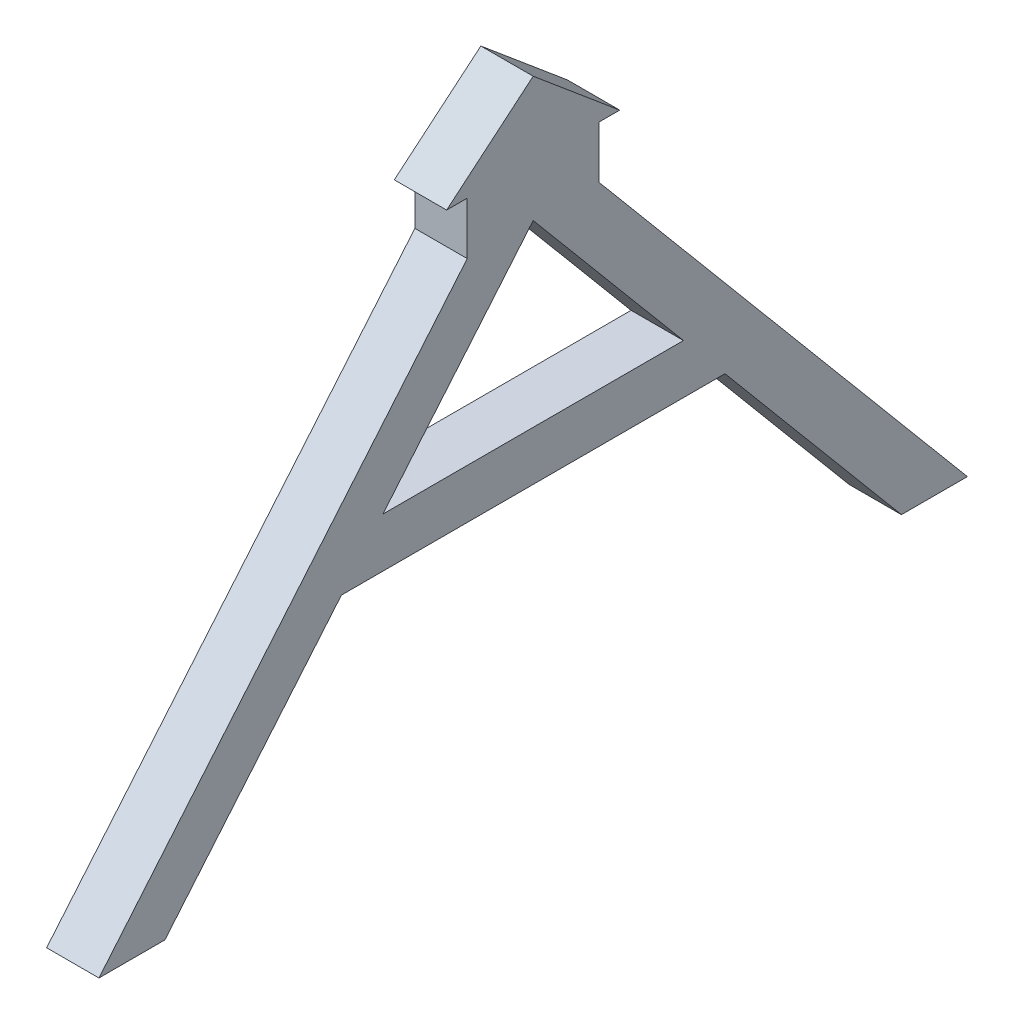
ISO-10303-21;
HEADER;
FILE_DESCRIPTION(('STEP AP214'),'2;1');
FILE_NAME('part.step','',(''),(''),'','','');
FILE_SCHEMA(('AUTOMOTIVE_DESIGN { 1 0 10303 214 1 1 1 1 }'));
ENDSEC;
DATA;
#1=APPLICATION_CONTEXT('core data for automotive mechanical design processes');
#2=APPLICATION_PROTOCOL_DEFINITION('international standard','automotive_design',2000,#1);
#3=PRODUCT_CONTEXT('',#1,'mechanical');
#4=PRODUCT('Part','Part','',(#3));
#5=PRODUCT_RELATED_PRODUCT_CATEGORY('part','',(#4));
#6=PRODUCT_DEFINITION_FORMATION('','',#4);
#7=PRODUCT_DEFINITION_CONTEXT('part definition',#1,'design');
#8=PRODUCT_DEFINITION('design','',#6,#7);
#9=PRODUCT_DEFINITION_SHAPE('','',#8);
#10=(LENGTH_UNIT() NAMED_UNIT(*) SI_UNIT(.MILLI.,.METRE.));
#11=(NAMED_UNIT(*) PLANE_ANGLE_UNIT() SI_UNIT($,.RADIAN.));
#12=(NAMED_UNIT(*) SI_UNIT($,.STERADIAN.) SOLID_ANGLE_UNIT());
#13=UNCERTAINTY_MEASURE_WITH_UNIT(LENGTH_MEASURE(1.E-05),#10,'distance_accuracy_value','');
#14=(GEOMETRIC_REPRESENTATION_CONTEXT(3) GLOBAL_UNCERTAINTY_ASSIGNED_CONTEXT((#13)) GLOBAL_UNIT_ASSIGNED_CONTEXT((#10,
#11,#12)) REPRESENTATION_CONTEXT('',''));
#15=CARTESIAN_POINT('',(0.,0.,0.));
#16=DIRECTION('',(0.,0.,1.));
#17=DIRECTION('',(1.,0.,0.));
#18=AXIS2_PLACEMENT_3D('',#15,#16,#17);
#19=CARTESIAN_POINT('',(3.175,0.,0.));
#20=DIRECTION('',(1.,0.,0.));
#21=DIRECTION('',(0.,0.,-1.));
#22=AXIS2_PLACEMENT_3D('',#19,#20,#21);
#23=PLANE('',#22);
#24=DIRECTION('',(0.,-0.642787609686535,0.766044443118982));
#25=VECTOR('',#24,1.);
#26=CARTESIAN_POINT('',(3.175,4.40527306368067,-5.25));
#27=LINE('',#26,#25);
#28=CARTESIAN_POINT('',(3.175,4.40527306368067,-5.25));
#29=VERTEX_POINT('',#28);
#30=CARTESIAN_POINT('',(3.175,0.,0.));
#31=VERTEX_POINT('',#30);
#32=EDGE_CURVE('E189',#29,#31,#27,.T.);
#33=ORIENTED_EDGE('',*,*,#32,.T.);
#34=DIRECTION('',(0.,0.,-1.));
#35=VECTOR('',#34,1.);
#36=CARTESIAN_POINT('',(3.175,0.,0.));
#37=LINE('',#36,#35);
#38=CARTESIAN_POINT('',(3.175,0.,-1.25));
#39=VERTEX_POINT('',#38);
#40=EDGE_CURVE('E193',#31,#39,#37,.T.);
#41=ORIENTED_EDGE('',*,*,#40,.T.);
#42=DIRECTION('',(0.,-1.,0.));
#43=VECTOR('',#42,1.);
#44=CARTESIAN_POINT('',(3.175,0.,-1.25));
#45=LINE('',#44,#43);
#46=CARTESIAN_POINT('',(3.175,-3.175,-1.25));
#47=VERTEX_POINT('',#46);
#48=EDGE_CURVE('E197',#39,#47,#45,.T.);
#49=ORIENTED_EDGE('',*,*,#48,.T.);
#50=DIRECTION('',(0.,-0.766044443118979,0.642787609686538));
#51=VECTOR('',#50,1.);
#52=CARTESIAN_POINT('',(3.175,-3.175,-1.25));
#53=LINE('',#52,#51);
#54=CARTESIAN_POINT('',(3.175,-29.7961311017385,21.0877812889907));
#55=VERTEX_POINT('',#54);
#56=EDGE_CURVE('E200',#47,#55,#53,.T.);
#57=ORIENTED_EDGE('',*,*,#56,.T.);
#58=DIRECTION('',(0.,0.,-1.));
#59=VECTOR('',#58,1.);
#60=CARTESIAN_POINT('',(3.175,-29.7961311017385,21.0877812889907));
#61=LINE('',#60,#59);
#62=CARTESIAN_POINT('',(3.175,-29.7961311017385,17.0877812889907));
#63=VERTEX_POINT('',#62);
#64=EDGE_CURVE('E203',#55,#63,#61,.T.);
#65=ORIENTED_EDGE('',*,*,#64,.T.);
#66=DIRECTION('',(0.,0.766044443118979,-0.642787609686538));
#67=VECTOR('',#66,1.);
#68=CARTESIAN_POINT('',(3.175,-29.7961311017385,17.0877812889907));
#69=LINE('',#68,#67);
#70=CARTESIAN_POINT('',(3.175,-17.0373961853233,6.38193152633806));
#71=VERTEX_POINT('',#70);
#72=EDGE_CURVE('E206',#63,#71,#69,.T.);
#73=ORIENTED_EDGE('',*,*,#72,.T.);
#74=DIRECTION('',(0.,0.,-1.));
#75=VECTOR('',#74,1.);
#76=CARTESIAN_POINT('',(3.175,-17.0373961853233,6.38193152633806));
#77=LINE('',#76,#75);
#78=CARTESIAN_POINT('',(3.175,-17.0373961853233,-16.8819315263381));
#79=VERTEX_POINT('',#78);
#80=EDGE_CURVE('E209',#71,#79,#77,.T.);
#81=ORIENTED_EDGE('',*,*,#80,.T.);
#82=DIRECTION('',(0.,-0.766044443118979,-0.642787609686538));
#83=VECTOR('',#82,1.);
#84=CARTESIAN_POINT('',(3.175,-17.0373961853233,-16.8819315263381));
#85=LINE('',#84,#83);
#86=CARTESIAN_POINT('',(3.175,-29.7961311017385,-27.5877812889907));
#87=VERTEX_POINT('',#86);
#88=EDGE_CURVE('E212',#79,#87,#85,.T.);
#89=ORIENTED_EDGE('',*,*,#88,.T.);
#90=DIRECTION('',(0.,0.,-1.));
#91=VECTOR('',#90,1.);
#92=CARTESIAN_POINT('',(3.175,-29.7961311017385,-27.5877812889907));
#93=LINE('',#92,#91);
#94=CARTESIAN_POINT('',(3.175,-29.7961311017385,-31.5877812889907));
#95=VERTEX_POINT('',#94);
#96=EDGE_CURVE('E215',#87,#95,#93,.T.);
#97=ORIENTED_EDGE('',*,*,#96,.T.);
#98=DIRECTION('',(0.,0.766044443118979,0.642787609686538));
#99=VECTOR('',#98,1.);
#100=CARTESIAN_POINT('',(3.175,-29.7961311017385,-31.5877812889907));
#101=LINE('',#100,#99);
#102=CARTESIAN_POINT('',(3.175,-3.175,-9.25));
#103=VERTEX_POINT('',#102);
#104=EDGE_CURVE('E218',#95,#103,#101,.T.);
#105=ORIENTED_EDGE('',*,*,#104,.T.);
#106=DIRECTION('',(0.,1.,0.));
#107=VECTOR('',#106,1.);
#108=CARTESIAN_POINT('',(3.175,0.,-9.25));
#109=LINE('',#108,#107);
#110=CARTESIAN_POINT('',(3.175,0.,-9.25));
#111=VERTEX_POINT('',#110);
#112=EDGE_CURVE('E221',#103,#111,#109,.T.);
#113=ORIENTED_EDGE('',*,*,#112,.T.);
#114=DIRECTION('',(0.,0.,-1.));
#115=VECTOR('',#114,1.);
#116=CARTESIAN_POINT('',(3.175,0.,-9.25));
#117=LINE('',#116,#115);
#118=CARTESIAN_POINT('',(3.175,0.,-10.5));
#119=VERTEX_POINT('',#118);
#120=EDGE_CURVE('E224',#111,#119,#117,.T.);
#121=ORIENTED_EDGE('',*,*,#120,.T.);
#122=DIRECTION('',(0.,0.642787609686535,0.766044443118982));
#123=VECTOR('',#122,1.);
#124=CARTESIAN_POINT('',(3.175,0.,-10.5));
#125=LINE('',#124,#123);
#126=EDGE_CURVE('E227',#119,#29,#125,.T.);
#127=ORIENTED_EDGE('',*,*,#126,.T.);
#128=EDGE_LOOP('',(#33,#41,#49,#57,#65,#73,#81,#89,#97,#105,#113,#121,#127));
#129=FACE_BOUND('',#128,.T.);
#130=DIRECTION('',(0.,0.,-1.));
#131=VECTOR('',#130,1.);
#132=CARTESIAN_POINT('',(3.175,-14.0373961853233,3.86463263280624));
#133=LINE('',#132,#131);
#134=CARTESIAN_POINT('',(3.175,-14.0373961853233,3.86463263280624));
#135=VERTEX_POINT('',#134);
#136=CARTESIAN_POINT('',(3.175,-14.0373961853233,-14.3646326328062));
#137=VERTEX_POINT('',#136);
#138=EDGE_CURVE('E162',#135,#137,#133,.T.);
#139=ORIENTED_EDGE('',*,*,#138,.F.);
#140=DIRECTION('',(0.,-0.766044443118979,0.642787609686538));
#141=VECTOR('',#140,1.);
#142=CARTESIAN_POINT('',(3.175,-14.0373961853233,3.86463263280624));
#143=LINE('',#142,#141);
#144=CARTESIAN_POINT('',(3.175,-3.175,-5.25));
#145=VERTEX_POINT('',#144);
#146=EDGE_CURVE('E153',#145,#135,#143,.T.);
#147=ORIENTED_EDGE('',*,*,#146,.F.);
#148=DIRECTION('',(0.,0.766044443118979,0.642787609686538));
#149=VECTOR('',#148,1.);
#150=CARTESIAN_POINT('',(3.175,-3.175,-5.25));
#151=LINE('',#150,#149);
#152=EDGE_CURVE('E172',#137,#145,#151,.T.);
#153=ORIENTED_EDGE('',*,*,#152,.F.);
#154=EDGE_LOOP('',(#139,#147,#153));
#155=FACE_BOUND('',#154,.T.);
#156=ADVANCED_FACE('F39',(#129,#155),#23,.T.);
#157=CARTESIAN_POINT('',(0.,0.,0.));
#158=DIRECTION('',(1.,0.,0.));
#159=DIRECTION('',(0.,0.,-1.));
#160=AXIS2_PLACEMENT_3D('',#157,#158,#159);
#161=PLANE('',#160);
#162=DIRECTION('',(0.,-0.642787609686535,0.766044443118982));
#163=VECTOR('',#162,1.);
#164=CARTESIAN_POINT('',(0.,4.40527306368067,-5.25));
#165=LINE('',#164,#163);
#166=CARTESIAN_POINT('',(0.,4.40527306368067,-5.25));
#167=VERTEX_POINT('',#166);
#168=CARTESIAN_POINT('',(0.,0.,0.));
#169=VERTEX_POINT('',#168);
#170=EDGE_CURVE('E170',#167,#169,#165,.T.);
#171=ORIENTED_EDGE('',*,*,#170,.F.);
#172=DIRECTION('',(0.,0.642787609686535,0.766044443118982));
#173=VECTOR('',#172,1.);
#174=CARTESIAN_POINT('',(0.,0.,-10.5));
#175=LINE('',#174,#173);
#176=CARTESIAN_POINT('',(0.,0.,-10.5));
#177=VERTEX_POINT('',#176);
#178=EDGE_CURVE('E194',#177,#167,#175,.T.);
#179=ORIENTED_EDGE('',*,*,#178,.F.);
#180=DIRECTION('',(0.,0.,-1.));
#181=VECTOR('',#180,1.);
#182=CARTESIAN_POINT('',(0.,0.,-9.25));
#183=LINE('',#182,#181);
#184=CARTESIAN_POINT('',(0.,0.,-9.25));
#185=VERTEX_POINT('',#184);
#186=EDGE_CURVE('E264',#185,#177,#183,.T.);
#187=ORIENTED_EDGE('',*,*,#186,.F.);
#188=DIRECTION('',(0.,1.,0.));
#189=VECTOR('',#188,1.);
#190=CARTESIAN_POINT('',(0.,0.,-9.25));
#191=LINE('',#190,#189);
#192=CARTESIAN_POINT('',(0.,-3.175,-9.25));
#193=VERTEX_POINT('',#192);
#194=EDGE_CURVE('E261',#193,#185,#191,.T.);
#195=ORIENTED_EDGE('',*,*,#194,.F.);
#196=DIRECTION('',(0.,0.766044443118979,0.642787609686538));
#197=VECTOR('',#196,1.);
#198=CARTESIAN_POINT('',(0.,-29.7961311017385,-31.5877812889907));
#199=LINE('',#198,#197);
#200=CARTESIAN_POINT('',(0.,-29.7961311017385,-31.5877812889907));
#201=VERTEX_POINT('',#200);
#202=EDGE_CURVE('E258',#201,#193,#199,.T.);
#203=ORIENTED_EDGE('',*,*,#202,.F.);
#204=DIRECTION('',(0.,0.,-1.));
#205=VECTOR('',#204,1.);
#206=CARTESIAN_POINT('',(0.,-29.7961311017385,-27.5877812889907));
#207=LINE('',#206,#205);
#208=CARTESIAN_POINT('',(0.,-29.7961311017385,-27.5877812889907));
#209=VERTEX_POINT('',#208);
#210=EDGE_CURVE('E255',#209,#201,#207,.T.);
#211=ORIENTED_EDGE('',*,*,#210,.F.);
#212=DIRECTION('',(0.,-0.766044443118979,-0.642787609686538));
#213=VECTOR('',#212,1.);
#214=CARTESIAN_POINT('',(0.,-17.0373961853233,-16.8819315263381));
#215=LINE('',#214,#213);
#216=CARTESIAN_POINT('',(0.,-17.0373961853233,-16.8819315263381));
#217=VERTEX_POINT('',#216);
#218=EDGE_CURVE('E252',#217,#209,#215,.T.);
#219=ORIENTED_EDGE('',*,*,#218,.F.);
#220=DIRECTION('',(0.,0.,-1.));
#221=VECTOR('',#220,1.);
#222=CARTESIAN_POINT('',(0.,-17.0373961853233,6.38193152633806));
#223=LINE('',#222,#221);
#224=CARTESIAN_POINT('',(0.,-17.0373961853233,6.38193152633806));
#225=VERTEX_POINT('',#224);
#226=EDGE_CURVE('E249',#225,#217,#223,.T.);
#227=ORIENTED_EDGE('',*,*,#226,.F.);
#228=DIRECTION('',(0.,0.766044443118979,-0.642787609686538));
#229=VECTOR('',#228,1.);
#230=CARTESIAN_POINT('',(0.,-29.7961311017385,17.0877812889907));
#231=LINE('',#230,#229);
#232=CARTESIAN_POINT('',(0.,-29.7961311017385,17.0877812889907));
#233=VERTEX_POINT('',#232);
#234=EDGE_CURVE('E246',#233,#225,#231,.T.);
#235=ORIENTED_EDGE('',*,*,#234,.F.);
#236=DIRECTION('',(0.,0.,-1.));
#237=VECTOR('',#236,1.);
#238=CARTESIAN_POINT('',(0.,-29.7961311017385,21.0877812889907));
#239=LINE('',#238,#237);
#240=CARTESIAN_POINT('',(0.,-29.7961311017385,21.0877812889907));
#241=VERTEX_POINT('',#240);
#242=EDGE_CURVE('E243',#241,#233,#239,.T.);
#243=ORIENTED_EDGE('',*,*,#242,.F.);
#244=DIRECTION('',(0.,-0.766044443118979,0.642787609686538));
#245=VECTOR('',#244,1.);
#246=CARTESIAN_POINT('',(0.,-3.175,-1.25));
#247=LINE('',#246,#245);
#248=CARTESIAN_POINT('',(0.,-3.175,-1.25));
#249=VERTEX_POINT('',#248);
#250=EDGE_CURVE('E240',#249,#241,#247,.T.);
#251=ORIENTED_EDGE('',*,*,#250,.F.);
#252=DIRECTION('',(0.,-1.,0.));
#253=VECTOR('',#252,1.);
#254=CARTESIAN_POINT('',(0.,0.,-1.25));
#255=LINE('',#254,#253);
#256=CARTESIAN_POINT('',(0.,0.,-1.25));
#257=VERTEX_POINT('',#256);
#258=EDGE_CURVE('E237',#257,#249,#255,.T.);
#259=ORIENTED_EDGE('',*,*,#258,.F.);
#260=DIRECTION('',(0.,0.,-1.));
#261=VECTOR('',#260,1.);
#262=CARTESIAN_POINT('',(0.,0.,0.));
#263=LINE('',#262,#261);
#264=EDGE_CURVE('E234',#169,#257,#263,.T.);
#265=ORIENTED_EDGE('',*,*,#264,.F.);
#266=EDGE_LOOP('',(#171,#179,#187,#195,#203,#211,#219,#227,#235,#243,#251,#259,#265));
#267=FACE_BOUND('',#266,.T.);
#268=DIRECTION('',(0.,-0.766044443118979,0.642787609686538));
#269=VECTOR('',#268,1.);
#270=CARTESIAN_POINT('',(0.,-14.0373961853233,3.86463263280624));
#271=LINE('',#270,#269);
#272=CARTESIAN_POINT('',(0.,-3.175,-5.25));
#273=VERTEX_POINT('',#272);
#274=CARTESIAN_POINT('',(0.,-14.0373961853233,3.86463263280624));
#275=VERTEX_POINT('',#274);
#276=EDGE_CURVE('E63',#273,#275,#271,.T.);
#277=ORIENTED_EDGE('',*,*,#276,.T.);
#278=DIRECTION('',(0.,0.,-1.));
#279=VECTOR('',#278,1.);
#280=CARTESIAN_POINT('',(0.,-14.0373961853233,3.86463263280624));
#281=LINE('',#280,#279);
#282=CARTESIAN_POINT('',(0.,-14.0373961853233,-14.3646326328062));
#283=VERTEX_POINT('',#282);
#284=EDGE_CURVE('E168',#275,#283,#281,.T.);
#285=ORIENTED_EDGE('',*,*,#284,.T.);
#286=DIRECTION('',(0.,0.766044443118979,0.642787609686538));
#287=VECTOR('',#286,1.);
#288=CARTESIAN_POINT('',(0.,-3.175,-5.25));
#289=LINE('',#288,#287);
#290=EDGE_CURVE('E163',#283,#273,#289,.T.);
#291=ORIENTED_EDGE('',*,*,#290,.T.);
#292=EDGE_LOOP('',(#277,#285,#291));
#293=FACE_BOUND('',#292,.T.);
#294=ADVANCED_FACE('F323',(#267,#293),#161,.F.);
#295=CARTESIAN_POINT('',(3.175,4.40527306368067,-5.25));
#296=DIRECTION('',(0.,-0.766044443118982,-0.642787609686535));
#297=DIRECTION('',(0.,0.642787609686535,-0.766044443118982));
#298=AXIS2_PLACEMENT_3D('',#295,#296,#297);
#299=PLANE('',#298);
#300=ORIENTED_EDGE('',*,*,#170,.T.);
#301=DIRECTION('',(-1.,0.,0.));
#302=VECTOR('',#301,1.);
#303=CARTESIAN_POINT('',(3.175,0.,0.));
#304=LINE('',#303,#302);
#305=EDGE_CURVE('E11',#31,#169,#304,.T.);
#306=ORIENTED_EDGE('',*,*,#305,.F.);
#307=ORIENTED_EDGE('',*,*,#32,.F.);
#308=DIRECTION('',(-1.,0.,0.));
#309=VECTOR('',#308,1.);
#310=CARTESIAN_POINT('',(3.175,4.40527306368067,-5.25));
#311=LINE('',#310,#309);
#312=EDGE_CURVE('E230',#29,#167,#311,.T.);
#313=ORIENTED_EDGE('',*,*,#312,.T.);
#314=EDGE_LOOP('',(#300,#306,#307,#313));
#315=FACE_BOUND('',#314,.T.);
#316=ADVANCED_FACE('F41',(#315),#299,.F.);
#317=CARTESIAN_POINT('',(3.175,0.,0.));
#318=DIRECTION('',(0.,1.,0.));
#319=DIRECTION('',(0.,0.,1.));
#320=AXIS2_PLACEMENT_3D('',#317,#318,#319);
#321=PLANE('',#320);
#322=ORIENTED_EDGE('',*,*,#264,.T.);
#323=DIRECTION('',(-1.,0.,0.));
#324=VECTOR('',#323,1.);
#325=CARTESIAN_POINT('',(3.175,0.,-1.25));
#326=LINE('',#325,#324);
#327=EDGE_CURVE('E48',#39,#257,#326,.T.);
#328=ORIENTED_EDGE('',*,*,#327,.F.);
#329=ORIENTED_EDGE('',*,*,#40,.F.);
#330=ORIENTED_EDGE('',*,*,#305,.T.);
#331=EDGE_LOOP('',(#322,#328,#329,#330));
#332=FACE_BOUND('',#331,.T.);
#333=ADVANCED_FACE('F340',(#332),#321,.F.);
#334=CARTESIAN_POINT('',(3.175,0.,-1.25));
#335=DIRECTION('',(0.,0.,-1.));
#336=DIRECTION('',(0.,1.,0.));
#337=AXIS2_PLACEMENT_3D('',#334,#335,#336);
#338=PLANE('',#337);
#339=ORIENTED_EDGE('',*,*,#258,.T.);
#340=DIRECTION('',(-1.,0.,0.));
#341=VECTOR('',#340,1.);
#342=CARTESIAN_POINT('',(3.175,-3.175,-1.25));
#343=LINE('',#342,#341);
#344=EDGE_CURVE('E308',#47,#249,#343,.T.);
#345=ORIENTED_EDGE('',*,*,#344,.F.);
#346=ORIENTED_EDGE('',*,*,#48,.F.);
#347=ORIENTED_EDGE('',*,*,#327,.T.);
#348=EDGE_LOOP('',(#339,#345,#346,#347));
#349=FACE_BOUND('',#348,.T.);
#350=ADVANCED_FACE('F317',(#349),#338,.F.);
#351=CARTESIAN_POINT('',(3.175,-3.175,-1.25));
#352=DIRECTION('',(0.,-0.642787609686538,-0.766044443118979));
#353=DIRECTION('',(0.,0.766044443118979,-0.642787609686538));
#354=AXIS2_PLACEMENT_3D('',#351,#352,#353);
#355=PLANE('',#354);
#356=ORIENTED_EDGE('',*,*,#250,.T.);
#357=DIRECTION('',(-1.,0.,0.));
#358=VECTOR('',#357,1.);
#359=CARTESIAN_POINT('',(3.175,-29.7961311017385,21.0877812889907));
#360=LINE('',#359,#358);
#361=EDGE_CURVE('E304',#55,#241,#360,.T.);
#362=ORIENTED_EDGE('',*,*,#361,.F.);
#363=ORIENTED_EDGE('',*,*,#56,.F.);
#364=ORIENTED_EDGE('',*,*,#344,.T.);
#365=EDGE_LOOP('',(#356,#362,#363,#364));
#366=FACE_BOUND('',#365,.T.);
#367=ADVANCED_FACE('F329',(#366),#355,.F.);
#368=CARTESIAN_POINT('',(3.175,-29.7961311017385,21.0877812889907));
#369=DIRECTION('',(0.,1.,0.));
#370=DIRECTION('',(0.,0.,1.));
#371=AXIS2_PLACEMENT_3D('',#368,#369,#370);
#372=PLANE('',#371);
#373=ORIENTED_EDGE('',*,*,#242,.T.);
#374=DIRECTION('',(-1.,0.,0.));
#375=VECTOR('',#374,1.);
#376=CARTESIAN_POINT('',(3.175,-29.7961311017385,17.0877812889907));
#377=LINE('',#376,#375);
#378=EDGE_CURVE('E300',#63,#233,#377,.T.);
#379=ORIENTED_EDGE('',*,*,#378,.F.);
#380=ORIENTED_EDGE('',*,*,#64,.F.);
#381=ORIENTED_EDGE('',*,*,#361,.T.);
#382=EDGE_LOOP('',(#373,#379,#380,#381));
#383=FACE_BOUND('',#382,.T.);
#384=ADVANCED_FACE('F333',(#383),#372,.F.);
#385=CARTESIAN_POINT('',(3.175,-29.7961311017385,17.0877812889907));
#386=DIRECTION('',(0.,0.642787609686538,0.766044443118979));
#387=DIRECTION('',(0.,-0.766044443118979,0.642787609686538));
#388=AXIS2_PLACEMENT_3D('',#385,#386,#387);
#389=PLANE('',#388);
#390=ORIENTED_EDGE('',*,*,#234,.T.);
#391=DIRECTION('',(-1.,0.,0.));
#392=VECTOR('',#391,1.);
#393=CARTESIAN_POINT('',(3.175,-17.0373961853233,6.38193152633806));
#394=LINE('',#393,#392);
#395=EDGE_CURVE('E296',#71,#225,#394,.T.);
#396=ORIENTED_EDGE('',*,*,#395,.F.);
#397=ORIENTED_EDGE('',*,*,#72,.F.);
#398=ORIENTED_EDGE('',*,*,#378,.T.);
#399=EDGE_LOOP('',(#390,#396,#397,#398));
#400=FACE_BOUND('',#399,.T.);
#401=ADVANCED_FACE('F378',(#400),#389,.F.);
#402=CARTESIAN_POINT('',(3.175,-17.0373961853233,6.38193152633806));
#403=DIRECTION('',(0.,1.,0.));
#404=DIRECTION('',(0.,0.,1.));
#405=AXIS2_PLACEMENT_3D('',#402,#403,#404);
#406=PLANE('',#405);
#407=ORIENTED_EDGE('',*,*,#226,.T.);
#408=DIRECTION('',(-1.,0.,0.));
#409=VECTOR('',#408,1.);
#410=CARTESIAN_POINT('',(3.175,-17.0373961853233,-16.8819315263381));
#411=LINE('',#410,#409);
#412=EDGE_CURVE('E292',#79,#217,#411,.T.);
#413=ORIENTED_EDGE('',*,*,#412,.F.);
#414=ORIENTED_EDGE('',*,*,#80,.F.);
#415=ORIENTED_EDGE('',*,*,#395,.T.);
#416=EDGE_LOOP('',(#407,#413,#414,#415));
#417=FACE_BOUND('',#416,.T.);
#418=ADVANCED_FACE('F375',(#417),#406,.F.);
#419=CARTESIAN_POINT('',(3.175,-17.0373961853233,-16.8819315263381));
#420=DIRECTION('',(0.,0.642787609686538,-0.766044443118979));
#421=DIRECTION('',(0.,0.76604444311898,0.642787609686538));
#422=AXIS2_PLACEMENT_3D('',#419,#420,#421);
#423=PLANE('',#422);
#424=ORIENTED_EDGE('',*,*,#218,.T.);
#425=DIRECTION('',(-1.,0.,0.));
#426=VECTOR('',#425,1.);
#427=CARTESIAN_POINT('',(3.175,-29.7961311017385,-27.5877812889907));
#428=LINE('',#427,#426);
#429=EDGE_CURVE('E288',#87,#209,#428,.T.);
#430=ORIENTED_EDGE('',*,*,#429,.F.);
#431=ORIENTED_EDGE('',*,*,#88,.F.);
#432=ORIENTED_EDGE('',*,*,#412,.T.);
#433=EDGE_LOOP('',(#424,#430,#431,#432));
#434=FACE_BOUND('',#433,.T.);
#435=ADVANCED_FACE('F371',(#434),#423,.F.);
#436=CARTESIAN_POINT('',(3.175,-29.7961311017385,-27.5877812889907));
#437=DIRECTION('',(0.,1.,0.));
#438=DIRECTION('',(0.,0.,1.));
#439=AXIS2_PLACEMENT_3D('',#436,#437,#438);
#440=PLANE('',#439);
#441=ORIENTED_EDGE('',*,*,#210,.T.);
#442=DIRECTION('',(-1.,0.,0.));
#443=VECTOR('',#442,1.);
#444=CARTESIAN_POINT('',(3.175,-29.7961311017385,-31.5877812889907));
#445=LINE('',#444,#443);
#446=EDGE_CURVE('E284',#95,#201,#445,.T.);
#447=ORIENTED_EDGE('',*,*,#446,.F.);
#448=ORIENTED_EDGE('',*,*,#96,.F.);
#449=ORIENTED_EDGE('',*,*,#429,.T.);
#450=EDGE_LOOP('',(#441,#447,#448,#449));
#451=FACE_BOUND('',#450,.T.);
#452=ADVANCED_FACE('F367',(#451),#440,.F.);
#453=CARTESIAN_POINT('',(3.175,-29.7961311017385,-31.5877812889907));
#454=DIRECTION('',(0.,-0.642787609686538,0.766044443118979));
#455=DIRECTION('',(0.,-0.766044443118979,-0.642787609686538));
#456=AXIS2_PLACEMENT_3D('',#453,#454,#455);
#457=PLANE('',#456);
#458=ORIENTED_EDGE('',*,*,#202,.T.);
#459=DIRECTION('',(-1.,0.,0.));
#460=VECTOR('',#459,1.);
#461=CARTESIAN_POINT('',(3.175,-3.175,-9.25));
#462=LINE('',#461,#460);
#463=EDGE_CURVE('E280',#103,#193,#462,.T.);
#464=ORIENTED_EDGE('',*,*,#463,.F.);
#465=ORIENTED_EDGE('',*,*,#104,.F.);
#466=ORIENTED_EDGE('',*,*,#446,.T.);
#467=EDGE_LOOP('',(#458,#464,#465,#466));
#468=FACE_BOUND('',#467,.T.);
#469=ADVANCED_FACE('F362',(#468),#457,.F.);
#470=CARTESIAN_POINT('',(3.175,0.,-9.25));
#471=DIRECTION('',(0.,0.,1.));
#472=DIRECTION('',(0.,-1.,0.));
#473=AXIS2_PLACEMENT_3D('',#470,#471,#472);
#474=PLANE('',#473);
#475=ORIENTED_EDGE('',*,*,#194,.T.);
#476=DIRECTION('',(-1.,0.,0.));
#477=VECTOR('',#476,1.);
#478=CARTESIAN_POINT('',(3.175,0.,-9.25));
#479=LINE('',#478,#477);
#480=EDGE_CURVE('E276',#111,#185,#479,.T.);
#481=ORIENTED_EDGE('',*,*,#480,.F.);
#482=ORIENTED_EDGE('',*,*,#112,.F.);
#483=ORIENTED_EDGE('',*,*,#463,.T.);
#484=EDGE_LOOP('',(#475,#481,#482,#483));
#485=FACE_BOUND('',#484,.T.);
#486=ADVANCED_FACE('F356',(#485),#474,.F.);
#487=CARTESIAN_POINT('',(3.175,0.,-9.25));
#488=DIRECTION('',(0.,1.,0.));
#489=DIRECTION('',(0.,0.,1.));
#490=AXIS2_PLACEMENT_3D('',#487,#488,#489);
#491=PLANE('',#490);
#492=ORIENTED_EDGE('',*,*,#186,.T.);
#493=DIRECTION('',(-1.,0.,0.));
#494=VECTOR('',#493,1.);
#495=CARTESIAN_POINT('',(3.175,0.,-10.5));
#496=LINE('',#495,#494);
#497=EDGE_CURVE('E272',#119,#177,#496,.T.);
#498=ORIENTED_EDGE('',*,*,#497,.F.);
#499=ORIENTED_EDGE('',*,*,#120,.F.);
#500=ORIENTED_EDGE('',*,*,#480,.T.);
#501=EDGE_LOOP('',(#492,#498,#499,#500));
#502=FACE_BOUND('',#501,.T.);
#503=ADVANCED_FACE('F352',(#502),#491,.F.);
#504=CARTESIAN_POINT('',(3.175,0.,-10.5));
#505=DIRECTION('',(0.,-0.766044443118982,0.642787609686535));
#506=DIRECTION('',(0.,-0.642787609686535,-0.766044443118982));
#507=AXIS2_PLACEMENT_3D('',#504,#505,#506);
#508=PLANE('',#507);
#509=ORIENTED_EDGE('',*,*,#178,.T.);
#510=ORIENTED_EDGE('',*,*,#312,.F.);
#511=ORIENTED_EDGE('',*,*,#126,.F.);
#512=ORIENTED_EDGE('',*,*,#497,.T.);
#513=EDGE_LOOP('',(#509,#510,#511,#512));
#514=FACE_BOUND('',#513,.T.);
#515=ADVANCED_FACE('F347',(#514),#508,.F.);
#516=CARTESIAN_POINT('',(3.175,-14.0373961853233,3.86463263280624));
#517=DIRECTION('',(0.,-0.642787609686538,-0.766044443118979));
#518=DIRECTION('',(0.,0.766044443118979,-0.642787609686538));
#519=AXIS2_PLACEMENT_3D('',#516,#517,#518);
#520=PLANE('',#519);
#521=ORIENTED_EDGE('',*,*,#276,.F.);
#522=DIRECTION('',(-1.,0.,0.));
#523=VECTOR('',#522,1.);
#524=CARTESIAN_POINT('',(3.175,-3.175,-5.25));
#525=LINE('',#524,#523);
#526=EDGE_CURVE('E157',#145,#273,#525,.T.);
#527=ORIENTED_EDGE('',*,*,#526,.F.);
#528=ORIENTED_EDGE('',*,*,#146,.T.);
#529=DIRECTION('',(-1.,0.,0.));
#530=VECTOR('',#529,1.);
#531=CARTESIAN_POINT('',(3.175,-14.0373961853233,3.86463263280624));
#532=LINE('',#531,#530);
#533=EDGE_CURVE('E156',#135,#275,#532,.T.);
#534=ORIENTED_EDGE('',*,*,#533,.T.);
#535=EDGE_LOOP('',(#521,#527,#528,#534));
#536=FACE_BOUND('',#535,.T.);
#537=ADVANCED_FACE('F155',(#536),#520,.T.);
#538=CARTESIAN_POINT('',(3.175,-14.0373961853233,3.86463263280624));
#539=DIRECTION('',(0.,1.,0.));
#540=DIRECTION('',(0.,0.,1.));
#541=AXIS2_PLACEMENT_3D('',#538,#539,#540);
#542=PLANE('',#541);
#543=ORIENTED_EDGE('',*,*,#284,.F.);
#544=ORIENTED_EDGE('',*,*,#533,.F.);
#545=ORIENTED_EDGE('',*,*,#138,.T.);
#546=DIRECTION('',(-1.,0.,0.));
#547=VECTOR('',#546,1.);
#548=CARTESIAN_POINT('',(3.175,-14.0373961853233,-14.3646326328062));
#549=LINE('',#548,#547);
#550=EDGE_CURVE('E55',#137,#283,#549,.T.);
#551=ORIENTED_EDGE('',*,*,#550,.T.);
#552=EDGE_LOOP('',(#543,#544,#545,#551));
#553=FACE_BOUND('',#552,.T.);
#554=ADVANCED_FACE('F166',(#553),#542,.T.);
#555=CARTESIAN_POINT('',(3.175,-3.175,-5.25));
#556=DIRECTION('',(0.,-0.642787609686538,0.766044443118979));
#557=DIRECTION('',(0.,-0.766044443118979,-0.642787609686538));
#558=AXIS2_PLACEMENT_3D('',#555,#556,#557);
#559=PLANE('',#558);
#560=ORIENTED_EDGE('',*,*,#290,.F.);
#561=ORIENTED_EDGE('',*,*,#550,.F.);
#562=ORIENTED_EDGE('',*,*,#152,.T.);
#563=ORIENTED_EDGE('',*,*,#526,.T.);
#564=EDGE_LOOP('',(#560,#561,#562,#563));
#565=FACE_BOUND('',#564,.T.);
#566=ADVANCED_FACE('F442',(#565),#559,.T.);
#567=CLOSED_SHELL('',(#156,#294,#316,#333,#350,#367,#384,#401,#418,#435,#452,#469,#486,#503,
#515,#537,#554,#566));
#568=MANIFOLD_SOLID_BREP('B2',#567);
#569=ADVANCED_BREP_SHAPE_REPRESENTATION('',(#18,#568),#14);
#570=SHAPE_DEFINITION_REPRESENTATION(#9,#569);
ENDSEC;
END-ISO-10303-21;
